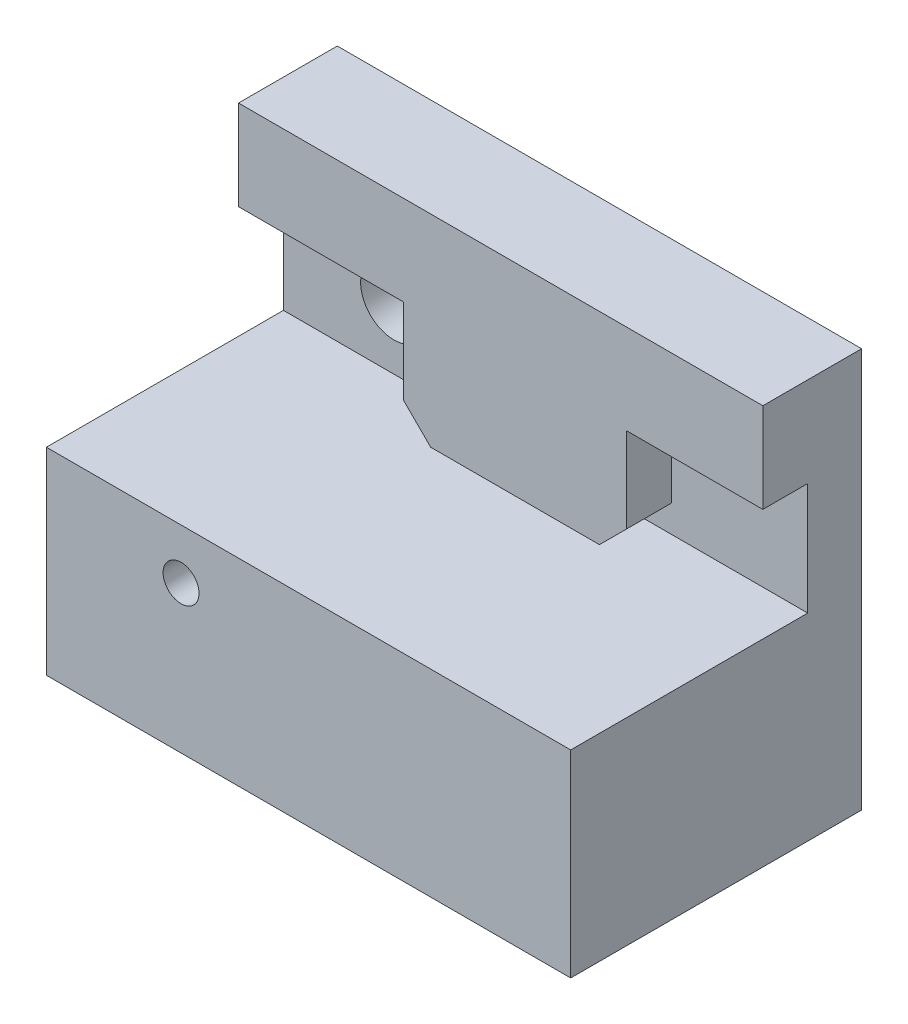
ISO-10303-21;
HEADER;
FILE_DESCRIPTION(('STEP AP214'),'2;1');
FILE_NAME('part.step','',(''),(''),'','','');
FILE_SCHEMA(('AUTOMOTIVE_DESIGN { 1 0 10303 214 1 1 1 1 }'));
ENDSEC;
DATA;
#1=APPLICATION_CONTEXT('core data for automotive mechanical design processes');
#2=APPLICATION_PROTOCOL_DEFINITION('international standard','automotive_design',2000,#1);
#3=PRODUCT_CONTEXT('',#1,'mechanical');
#4=PRODUCT('Part','Part','',(#3));
#5=PRODUCT_RELATED_PRODUCT_CATEGORY('part','',(#4));
#6=PRODUCT_DEFINITION_FORMATION('','',#4);
#7=PRODUCT_DEFINITION_CONTEXT('part definition',#1,'design');
#8=PRODUCT_DEFINITION('design','',#6,#7);
#9=PRODUCT_DEFINITION_SHAPE('','',#8);
#10=(LENGTH_UNIT() NAMED_UNIT(*) SI_UNIT(.MILLI.,.METRE.));
#11=(NAMED_UNIT(*) PLANE_ANGLE_UNIT() SI_UNIT($,.RADIAN.));
#12=(NAMED_UNIT(*) SI_UNIT($,.STERADIAN.) SOLID_ANGLE_UNIT());
#13=UNCERTAINTY_MEASURE_WITH_UNIT(LENGTH_MEASURE(1.E-05),#10,'distance_accuracy_value','');
#14=(GEOMETRIC_REPRESENTATION_CONTEXT(3) GLOBAL_UNCERTAINTY_ASSIGNED_CONTEXT((#13)) GLOBAL_UNIT_ASSIGNED_CONTEXT((#10,
#11,#12)) REPRESENTATION_CONTEXT('',''));
#15=CARTESIAN_POINT('',(0.,0.,0.));
#16=DIRECTION('',(0.,0.,1.));
#17=DIRECTION('',(1.,0.,0.));
#18=AXIS2_PLACEMENT_3D('',#15,#16,#17);
#19=CARTESIAN_POINT('',(0.,11.,13.2));
#20=DIRECTION('',(0.,-1.,0.));
#21=DIRECTION('',(0.,0.,-1.));
#22=AXIS2_PLACEMENT_3D('',#19,#20,#21);
#23=PLANE('',#22);
#24=DIRECTION('',(0.,0.,-1.));
#25=VECTOR('',#24,1.);
#26=CARTESIAN_POINT('',(20.1,11.,2.5));
#27=LINE('',#26,#25);
#28=CARTESIAN_POINT('',(20.1,11.,2.5));
#29=VERTEX_POINT('',#28);
#30=CARTESIAN_POINT('',(20.1,11.,0.));
#31=VERTEX_POINT('',#30);
#32=EDGE_CURVE('E235',#29,#31,#27,.T.);
#33=ORIENTED_EDGE('',*,*,#32,.F.);
#34=DIRECTION('',(-1.,0.,0.));
#35=VECTOR('',#34,1.);
#36=CARTESIAN_POINT('',(20.1,11.,2.5));
#37=LINE('',#36,#35);
#38=CARTESIAN_POINT('',(10.7,11.,2.5));
#39=VERTEX_POINT('',#38);
#40=EDGE_CURVE('E185',#29,#39,#37,.T.);
#41=ORIENTED_EDGE('',*,*,#40,.T.);
#42=DIRECTION('',(0.,0.,-1.));
#43=VECTOR('',#42,1.);
#44=CARTESIAN_POINT('',(10.7,11.,2.5));
#45=LINE('',#44,#43);
#46=CARTESIAN_POINT('',(10.7,11.,0.));
#47=VERTEX_POINT('',#46);
#48=EDGE_CURVE('E226',#39,#47,#45,.T.);
#49=ORIENTED_EDGE('',*,*,#48,.T.);
#50=DIRECTION('',(-1.,0.,0.));
#51=VECTOR('',#50,1.);
#52=CARTESIAN_POINT('',(0.,11.,0.));
#53=LINE('',#52,#51);
#54=CARTESIAN_POINT('',(0.,11.,0.));
#55=VERTEX_POINT('',#54);
#56=EDGE_CURVE('E273',#47,#55,#53,.T.);
#57=ORIENTED_EDGE('',*,*,#56,.T.);
#58=DIRECTION('',(0.,0.,-1.));
#59=VECTOR('',#58,1.);
#60=CARTESIAN_POINT('',(0.,11.,13.2));
#61=LINE('',#60,#59);
#62=CARTESIAN_POINT('',(0.,11.,13.2));
#63=VERTEX_POINT('',#62);
#64=EDGE_CURVE('E43',#63,#55,#61,.T.);
#65=ORIENTED_EDGE('',*,*,#64,.F.);
#66=DIRECTION('',(-1.,0.,0.));
#67=VECTOR('',#66,1.);
#68=CARTESIAN_POINT('',(0.,11.,13.2));
#69=LINE('',#68,#67);
#70=CARTESIAN_POINT('',(29.2,11.,13.2));
#71=VERTEX_POINT('',#70);
#72=EDGE_CURVE('E275',#71,#63,#69,.T.);
#73=ORIENTED_EDGE('',*,*,#72,.F.);
#74=DIRECTION('',(0.,0.,-1.));
#75=VECTOR('',#74,1.);
#76=CARTESIAN_POINT('',(29.2,11.,13.2));
#77=LINE('',#76,#75);
#78=CARTESIAN_POINT('',(29.2,11.,0.));
#79=VERTEX_POINT('',#78);
#80=EDGE_CURVE('E11',#71,#79,#77,.T.);
#81=ORIENTED_EDGE('',*,*,#80,.T.);
#82=EDGE_CURVE('E276',#79,#31,#53,.T.);
#83=ORIENTED_EDGE('',*,*,#82,.T.);
#84=EDGE_LOOP('',(#33,#41,#49,#57,#65,#73,#81,#83));
#85=FACE_BOUND('',#84,.T.);
#86=ADVANCED_FACE('F33',(#85),#23,.F.);
#87=CARTESIAN_POINT('',(7.5,8.2,13.2));
#88=DIRECTION('',(0.,0.,-1.));
#89=DIRECTION('',(-1.,0.,0.));
#90=AXIS2_PLACEMENT_3D('',#87,#88,#89);
#91=CYLINDRICAL_SURFACE('',#90,1.);
#92=CARTESIAN_POINT('',(7.5,8.2,13.2));
#93=DIRECTION('',(0.,0.,1.));
#94=DIRECTION('',(1.,0.,0.));
#95=AXIS2_PLACEMENT_3D('',#92,#93,#94);
#96=CIRCLE('',#95,1.);
#97=CARTESIAN_POINT('',(8.5,8.2,13.2));
#98=VERTEX_POINT('',#97);
#99=EDGE_CURVE('E268',#98,#98,#96,.T.);
#100=ORIENTED_EDGE('',*,*,#99,.T.);
#101=EDGE_LOOP('',(#100));
#102=FACE_BOUND('',#101,.T.);
#103=CARTESIAN_POINT('',(7.5,8.2,11.5));
#104=DIRECTION('',(0.,0.,-1.));
#105=DIRECTION('',(-1.,0.,0.));
#106=AXIS2_PLACEMENT_3D('',#103,#104,#105);
#107=CIRCLE('',#106,1.);
#108=CARTESIAN_POINT('',(6.5,8.2,11.5));
#109=VERTEX_POINT('',#108);
#110=EDGE_CURVE('E263',#109,#109,#107,.T.);
#111=ORIENTED_EDGE('',*,*,#110,.T.);
#112=EDGE_LOOP('',(#111));
#113=FACE_BOUND('',#112,.T.);
#114=ADVANCED_FACE('F314',(#102,#113),#91,.F.);
#115=CARTESIAN_POINT('',(0.,0.,13.2));
#116=DIRECTION('',(0.,0.,1.));
#117=DIRECTION('',(1.,0.,0.));
#118=AXIS2_PLACEMENT_3D('',#115,#116,#117);
#119=PLANE('',#118);
#120=DIRECTION('',(0.,1.,0.));
#121=VECTOR('',#120,1.);
#122=CARTESIAN_POINT('',(29.2,11.,13.2));
#123=LINE('',#122,#121);
#124=CARTESIAN_POINT('',(29.2,0.,13.2));
#125=VERTEX_POINT('',#124);
#126=EDGE_CURVE('E141',#125,#71,#123,.T.);
#127=ORIENTED_EDGE('',*,*,#126,.T.);
#128=ORIENTED_EDGE('',*,*,#72,.T.);
#129=DIRECTION('',(0.,-1.,0.));
#130=VECTOR('',#129,1.);
#131=CARTESIAN_POINT('',(0.,11.,13.2));
#132=LINE('',#131,#130);
#133=CARTESIAN_POINT('',(0.,0.,13.2));
#134=VERTEX_POINT('',#133);
#135=EDGE_CURVE('E56',#63,#134,#132,.T.);
#136=ORIENTED_EDGE('',*,*,#135,.T.);
#137=DIRECTION('',(1.,0.,0.));
#138=VECTOR('',#137,1.);
#139=CARTESIAN_POINT('',(0.,0.,13.2));
#140=LINE('',#139,#138);
#141=EDGE_CURVE('E51',#134,#125,#140,.T.);
#142=ORIENTED_EDGE('',*,*,#141,.T.);
#143=EDGE_LOOP('',(#127,#128,#136,#142));
#144=FACE_BOUND('',#143,.T.);
#145=ORIENTED_EDGE('',*,*,#99,.F.);
#146=EDGE_LOOP('',(#145));
#147=FACE_BOUND('',#146,.T.);
#148=ADVANCED_FACE('F311',(#144,#147),#119,.T.);
#149=CARTESIAN_POINT('',(29.2,11.,13.2));
#150=DIRECTION('',(-1.,0.,0.));
#151=DIRECTION('',(0.,-1.,0.));
#152=AXIS2_PLACEMENT_3D('',#149,#150,#151);
#153=PLANE('',#152);
#154=DIRECTION('',(0.,0.,-1.));
#155=VECTOR('',#154,1.);
#156=CARTESIAN_POINT('',(29.2,0.,13.2));
#157=LINE('',#156,#155);
#158=CARTESIAN_POINT('',(29.2,0.,-3.));
#159=VERTEX_POINT('',#158);
#160=EDGE_CURVE('E137',#125,#159,#157,.T.);
#161=ORIENTED_EDGE('',*,*,#160,.T.);
#162=DIRECTION('',(0.,-1.,0.));
#163=VECTOR('',#162,1.);
#164=CARTESIAN_POINT('',(29.2,22.25,-3.));
#165=LINE('',#164,#163);
#166=CARTESIAN_POINT('',(29.2,22.25,-3.));
#167=VERTEX_POINT('',#166);
#168=EDGE_CURVE('E139',#167,#159,#165,.T.);
#169=ORIENTED_EDGE('',*,*,#168,.F.);
#170=DIRECTION('',(0.,0.,-1.));
#171=VECTOR('',#170,1.);
#172=CARTESIAN_POINT('',(29.2,22.25,2.5));
#173=LINE('',#172,#171);
#174=CARTESIAN_POINT('',(29.2,22.25,2.5));
#175=VERTEX_POINT('',#174);
#176=EDGE_CURVE('E214',#175,#167,#173,.T.);
#177=ORIENTED_EDGE('',*,*,#176,.F.);
#178=DIRECTION('',(0.,-1.,0.));
#179=VECTOR('',#178,1.);
#180=CARTESIAN_POINT('',(29.2,22.25,2.5));
#181=LINE('',#180,#179);
#182=CARTESIAN_POINT('',(29.2,17.25,2.5));
#183=VERTEX_POINT('',#182);
#184=EDGE_CURVE('E203',#175,#183,#181,.T.);
#185=ORIENTED_EDGE('',*,*,#184,.T.);
#186=DIRECTION('',(0.,0.,-1.));
#187=VECTOR('',#186,1.);
#188=CARTESIAN_POINT('',(29.2,17.25,2.5));
#189=LINE('',#188,#187);
#190=CARTESIAN_POINT('',(29.2,17.25,0.));
#191=VERTEX_POINT('',#190);
#192=EDGE_CURVE('E216',#183,#191,#189,.T.);
#193=ORIENTED_EDGE('',*,*,#192,.T.);
#194=DIRECTION('',(0.,-1.,0.));
#195=VECTOR('',#194,1.);
#196=CARTESIAN_POINT('',(29.2,10.75,0.));
#197=LINE('',#196,#195);
#198=EDGE_CURVE('E169',#191,#79,#197,.T.);
#199=ORIENTED_EDGE('',*,*,#198,.T.);
#200=ORIENTED_EDGE('',*,*,#80,.F.);
#201=ORIENTED_EDGE('',*,*,#126,.F.);
#202=EDGE_LOOP('',(#161,#169,#177,#185,#193,#199,#200,#201));
#203=FACE_BOUND('',#202,.T.);
#204=ADVANCED_FACE('F35',(#203),#153,.F.);
#205=CARTESIAN_POINT('',(0.,11.,13.2));
#206=DIRECTION('',(1.,0.,0.));
#207=DIRECTION('',(0.,1.,0.));
#208=AXIS2_PLACEMENT_3D('',#205,#206,#207);
#209=PLANE('',#208);
#210=ORIENTED_EDGE('',*,*,#64,.T.);
#211=DIRECTION('',(0.,1.,0.));
#212=VECTOR('',#211,1.);
#213=CARTESIAN_POINT('',(0.,22.25,0.));
#214=LINE('',#213,#212);
#215=CARTESIAN_POINT('',(0.,17.25,0.));
#216=VERTEX_POINT('',#215);
#217=EDGE_CURVE('E156',#55,#216,#214,.T.);
#218=ORIENTED_EDGE('',*,*,#217,.T.);
#219=DIRECTION('',(0.,0.,-1.));
#220=VECTOR('',#219,1.);
#221=CARTESIAN_POINT('',(0.,17.25,2.5));
#222=LINE('',#221,#220);
#223=CARTESIAN_POINT('',(0.,17.25,2.5));
#224=VERTEX_POINT('',#223);
#225=EDGE_CURVE('E219',#224,#216,#222,.T.);
#226=ORIENTED_EDGE('',*,*,#225,.F.);
#227=DIRECTION('',(0.,1.,0.));
#228=VECTOR('',#227,1.);
#229=CARTESIAN_POINT('',(0.,17.25,2.5));
#230=LINE('',#229,#228);
#231=CARTESIAN_POINT('',(0.,22.25,2.5));
#232=VERTEX_POINT('',#231);
#233=EDGE_CURVE('E197',#224,#232,#230,.T.);
#234=ORIENTED_EDGE('',*,*,#233,.T.);
#235=DIRECTION('',(0.,0.,-1.));
#236=VECTOR('',#235,1.);
#237=CARTESIAN_POINT('',(0.,22.25,2.5));
#238=LINE('',#237,#236);
#239=CARTESIAN_POINT('',(0.,22.25,-3.));
#240=VERTEX_POINT('',#239);
#241=EDGE_CURVE('E217',#232,#240,#238,.T.);
#242=ORIENTED_EDGE('',*,*,#241,.T.);
#243=DIRECTION('',(0.,1.,0.));
#244=VECTOR('',#243,1.);
#245=CARTESIAN_POINT('',(0.,10.75,-3.));
#246=LINE('',#245,#244);
#247=CARTESIAN_POINT('',(0.,0.,-3.));
#248=VERTEX_POINT('',#247);
#249=EDGE_CURVE('E159',#248,#240,#246,.T.);
#250=ORIENTED_EDGE('',*,*,#249,.F.);
#251=DIRECTION('',(0.,0.,-1.));
#252=VECTOR('',#251,1.);
#253=CARTESIAN_POINT('',(0.,0.,13.2));
#254=LINE('',#253,#252);
#255=EDGE_CURVE('E144',#134,#248,#254,.T.);
#256=ORIENTED_EDGE('',*,*,#255,.F.);
#257=ORIENTED_EDGE('',*,*,#135,.F.);
#258=EDGE_LOOP('',(#210,#218,#226,#234,#242,#250,#256,#257));
#259=FACE_BOUND('',#258,.T.);
#260=ADVANCED_FACE('F293',(#259),#209,.F.);
#261=CARTESIAN_POINT('',(0.,0.,13.2));
#262=DIRECTION('',(0.,1.,0.));
#263=DIRECTION('',(0.,0.,1.));
#264=AXIS2_PLACEMENT_3D('',#261,#262,#263);
#265=PLANE('',#264);
#266=ORIENTED_EDGE('',*,*,#255,.T.);
#267=DIRECTION('',(-1.,0.,0.));
#268=VECTOR('',#267,1.);
#269=CARTESIAN_POINT('',(0.,0.,-3.));
#270=LINE('',#269,#268);
#271=EDGE_CURVE('E152',#159,#248,#270,.T.);
#272=ORIENTED_EDGE('',*,*,#271,.F.);
#273=ORIENTED_EDGE('',*,*,#160,.F.);
#274=ORIENTED_EDGE('',*,*,#141,.F.);
#275=EDGE_LOOP('',(#266,#272,#273,#274));
#276=FACE_BOUND('',#275,.T.);
#277=ADVANCED_FACE('F158',(#276),#265,.F.);
#278=CARTESIAN_POINT('',(7.5,8.2,11.5));
#279=DIRECTION('',(0.,0.,-1.));
#280=DIRECTION('',(-1.,0.,0.));
#281=AXIS2_PLACEMENT_3D('',#278,#279,#280);
#282=CYLINDRICAL_SURFACE('',#281,1.85);
#283=CARTESIAN_POINT('',(7.5,8.2,11.5));
#284=DIRECTION('',(0.,0.,-1.));
#285=DIRECTION('',(-1.,0.,0.));
#286=AXIS2_PLACEMENT_3D('',#283,#284,#285);
#287=CIRCLE('',#286,1.85);
#288=CARTESIAN_POINT('',(5.65,8.2,11.5));
#289=VERTEX_POINT('',#288);
#290=EDGE_CURVE('E259',#289,#289,#287,.T.);
#291=ORIENTED_EDGE('',*,*,#290,.F.);
#292=EDGE_LOOP('',(#291));
#293=FACE_BOUND('',#292,.T.);
#294=CARTESIAN_POINT('',(7.49999999999998,8.2,-3.));
#295=DIRECTION('',(0.,0.,-1.));
#296=DIRECTION('',(1.,0.,0.));
#297=AXIS2_PLACEMENT_3D('',#294,#295,#296);
#298=CIRCLE('',#297,1.85000000000003);
#299=CARTESIAN_POINT('',(9.35000000000001,8.2,-3.));
#300=VERTEX_POINT('',#299);
#301=EDGE_CURVE('E172',#300,#300,#298,.T.);
#302=ORIENTED_EDGE('',*,*,#301,.T.);
#303=EDGE_LOOP('',(#302));
#304=FACE_BOUND('',#303,.T.);
#305=ADVANCED_FACE('F325',(#293,#304),#282,.F.);
#306=CARTESIAN_POINT('',(7.5,8.2,11.5));
#307=DIRECTION('',(0.,0.,-1.));
#308=DIRECTION('',(-1.,0.,0.));
#309=AXIS2_PLACEMENT_3D('',#306,#307,#308);
#310=PLANE('',#309);
#311=ORIENTED_EDGE('',*,*,#110,.F.);
#312=EDGE_LOOP('',(#311));
#313=FACE_BOUND('',#312,.T.);
#314=ORIENTED_EDGE('',*,*,#290,.T.);
#315=EDGE_LOOP('',(#314));
#316=FACE_BOUND('',#315,.T.);
#317=ADVANCED_FACE('F323',(#313,#316),#310,.T.);
#318=CARTESIAN_POINT('',(29.2,17.25,2.5));
#319=DIRECTION('',(0.,-1.,0.));
#320=DIRECTION('',(0.,0.,-1.));
#321=AXIS2_PLACEMENT_3D('',#318,#319,#320);
#322=PLANE('',#321);
#323=DIRECTION('',(-1.,0.,0.));
#324=VECTOR('',#323,1.);
#325=CARTESIAN_POINT('',(29.2,17.25,0.));
#326=LINE('',#325,#324);
#327=CARTESIAN_POINT('',(21.6,17.25,0.));
#328=VERTEX_POINT('',#327);
#329=EDGE_CURVE('E37',#191,#328,#326,.T.);
#330=ORIENTED_EDGE('',*,*,#329,.F.);
#331=ORIENTED_EDGE('',*,*,#192,.F.);
#332=DIRECTION('',(-1.,0.,0.));
#333=VECTOR('',#332,1.);
#334=CARTESIAN_POINT('',(29.2,17.25,2.5));
#335=LINE('',#334,#333);
#336=CARTESIAN_POINT('',(21.6,17.25,2.5));
#337=VERTEX_POINT('',#336);
#338=EDGE_CURVE('E175',#183,#337,#335,.T.);
#339=ORIENTED_EDGE('',*,*,#338,.T.);
#340=DIRECTION('',(0.,0.,-1.));
#341=VECTOR('',#340,1.);
#342=CARTESIAN_POINT('',(21.6,17.25,2.5));
#343=LINE('',#342,#341);
#344=EDGE_CURVE('E205',#337,#328,#343,.T.);
#345=ORIENTED_EDGE('',*,*,#344,.T.);
#346=EDGE_LOOP('',(#330,#331,#339,#345));
#347=FACE_BOUND('',#346,.T.);
#348=ADVANCED_FACE('F306',(#347),#322,.T.);
#349=CARTESIAN_POINT('',(29.2,22.25,2.5));
#350=DIRECTION('',(0.,1.,0.));
#351=DIRECTION('',(0.,0.,1.));
#352=AXIS2_PLACEMENT_3D('',#349,#350,#351);
#353=PLANE('',#352);
#354=ORIENTED_EDGE('',*,*,#176,.T.);
#355=DIRECTION('',(1.,0.,0.));
#356=VECTOR('',#355,1.);
#357=CARTESIAN_POINT('',(29.2,22.25,-3.));
#358=LINE('',#357,#356);
#359=EDGE_CURVE('E155',#240,#167,#358,.T.);
#360=ORIENTED_EDGE('',*,*,#359,.F.);
#361=ORIENTED_EDGE('',*,*,#241,.F.);
#362=DIRECTION('',(1.,0.,0.));
#363=VECTOR('',#362,1.);
#364=CARTESIAN_POINT('',(29.2,22.25,2.5));
#365=LINE('',#364,#363);
#366=EDGE_CURVE('E200',#232,#175,#365,.T.);
#367=ORIENTED_EDGE('',*,*,#366,.T.);
#368=EDGE_LOOP('',(#354,#360,#361,#367));
#369=FACE_BOUND('',#368,.T.);
#370=ADVANCED_FACE('F295',(#369),#353,.T.);
#371=CARTESIAN_POINT('',(9.2,17.25,2.5));
#372=DIRECTION('',(0.,-1.,0.));
#373=DIRECTION('',(0.,0.,-1.));
#374=AXIS2_PLACEMENT_3D('',#371,#372,#373);
#375=PLANE('',#374);
#376=DIRECTION('',(-1.,0.,0.));
#377=VECTOR('',#376,1.);
#378=CARTESIAN_POINT('',(9.2,17.25,0.));
#379=LINE('',#378,#377);
#380=CARTESIAN_POINT('',(9.2,17.25,0.));
#381=VERTEX_POINT('',#380);
#382=EDGE_CURVE('E179',#381,#216,#379,.T.);
#383=ORIENTED_EDGE('',*,*,#382,.F.);
#384=DIRECTION('',(0.,0.,-1.));
#385=VECTOR('',#384,1.);
#386=CARTESIAN_POINT('',(9.2,17.25,2.5));
#387=LINE('',#386,#385);
#388=CARTESIAN_POINT('',(9.2,17.25,2.5));
#389=VERTEX_POINT('',#388);
#390=EDGE_CURVE('E220',#389,#381,#387,.T.);
#391=ORIENTED_EDGE('',*,*,#390,.F.);
#392=DIRECTION('',(-1.,0.,0.));
#393=VECTOR('',#392,1.);
#394=CARTESIAN_POINT('',(9.2,17.25,2.5));
#395=LINE('',#394,#393);
#396=EDGE_CURVE('E194',#389,#224,#395,.T.);
#397=ORIENTED_EDGE('',*,*,#396,.T.);
#398=ORIENTED_EDGE('',*,*,#225,.T.);
#399=EDGE_LOOP('',(#383,#391,#397,#398));
#400=FACE_BOUND('',#399,.T.);
#401=ADVANCED_FACE('F368',(#400),#375,.T.);
#402=CARTESIAN_POINT('',(9.2,12.5,2.5));
#403=DIRECTION('',(-1.,0.,0.));
#404=DIRECTION('',(0.,0.,1.));
#405=AXIS2_PLACEMENT_3D('',#402,#403,#404);
#406=PLANE('',#405);
#407=DIRECTION('',(0.,1.,0.));
#408=VECTOR('',#407,1.);
#409=CARTESIAN_POINT('',(9.2,12.5,0.));
#410=LINE('',#409,#408);
#411=CARTESIAN_POINT('',(9.2,12.5,0.));
#412=VERTEX_POINT('',#411);
#413=EDGE_CURVE('E211',#412,#381,#410,.T.);
#414=ORIENTED_EDGE('',*,*,#413,.F.);
#415=DIRECTION('',(0.,0.,-1.));
#416=VECTOR('',#415,1.);
#417=CARTESIAN_POINT('',(9.2,12.5,2.5));
#418=LINE('',#417,#416);
#419=CARTESIAN_POINT('',(9.2,12.5,2.5));
#420=VERTEX_POINT('',#419);
#421=EDGE_CURVE('E223',#420,#412,#418,.T.);
#422=ORIENTED_EDGE('',*,*,#421,.F.);
#423=DIRECTION('',(0.,1.,0.));
#424=VECTOR('',#423,1.);
#425=CARTESIAN_POINT('',(9.2,12.5,2.5));
#426=LINE('',#425,#424);
#427=EDGE_CURVE('E191',#420,#389,#426,.T.);
#428=ORIENTED_EDGE('',*,*,#427,.T.);
#429=ORIENTED_EDGE('',*,*,#390,.T.);
#430=EDGE_LOOP('',(#414,#422,#428,#429));
#431=FACE_BOUND('',#430,.T.);
#432=ADVANCED_FACE('F378',(#431),#406,.T.);
#433=CARTESIAN_POINT('',(10.7,11.,2.5));
#434=DIRECTION('',(-0.707106781186549,-0.707106781186546,0.));
#435=DIRECTION('',(0.707106781186546,-0.707106781186549,0.));
#436=AXIS2_PLACEMENT_3D('',#433,#434,#435);
#437=PLANE('',#436);
#438=DIRECTION('',(-0.707106781186546,0.707106781186549,0.));
#439=VECTOR('',#438,1.);
#440=CARTESIAN_POINT('',(10.7,11.,0.));
#441=LINE('',#440,#439);
#442=EDGE_CURVE('E213',#47,#412,#441,.T.);
#443=ORIENTED_EDGE('',*,*,#442,.F.);
#444=ORIENTED_EDGE('',*,*,#48,.F.);
#445=DIRECTION('',(-0.707106781186546,0.707106781186549,0.));
#446=VECTOR('',#445,1.);
#447=CARTESIAN_POINT('',(10.7,11.,2.5));
#448=LINE('',#447,#446);
#449=EDGE_CURVE('E188',#39,#420,#448,.T.);
#450=ORIENTED_EDGE('',*,*,#449,.T.);
#451=ORIENTED_EDGE('',*,*,#421,.T.);
#452=EDGE_LOOP('',(#443,#444,#450,#451));
#453=FACE_BOUND('',#452,.T.);
#454=ADVANCED_FACE('F388',(#453),#437,.T.);
#455=CARTESIAN_POINT('',(20.1,11.,2.5));
#456=DIRECTION('',(0.707106781186549,-0.707106781186546,0.));
#457=DIRECTION('',(0.707106781186546,0.707106781186549,0.));
#458=AXIS2_PLACEMENT_3D('',#455,#456,#457);
#459=PLANE('',#458);
#460=DIRECTION('',(-0.707106781186546,-0.707106781186549,0.));
#461=VECTOR('',#460,1.);
#462=CARTESIAN_POINT('',(20.1,11.,0.));
#463=LINE('',#462,#461);
#464=CARTESIAN_POINT('',(21.6,12.5,0.));
#465=VERTEX_POINT('',#464);
#466=EDGE_CURVE('E210',#465,#31,#463,.T.);
#467=ORIENTED_EDGE('',*,*,#466,.F.);
#468=DIRECTION('',(0.,0.,-1.));
#469=VECTOR('',#468,1.);
#470=CARTESIAN_POINT('',(21.6,12.5,2.5));
#471=LINE('',#470,#469);
#472=CARTESIAN_POINT('',(21.6,12.5,2.5));
#473=VERTEX_POINT('',#472);
#474=EDGE_CURVE('E229',#473,#465,#471,.T.);
#475=ORIENTED_EDGE('',*,*,#474,.F.);
#476=DIRECTION('',(-0.707106781186546,-0.707106781186549,0.));
#477=VECTOR('',#476,1.);
#478=CARTESIAN_POINT('',(20.1,11.,2.5));
#479=LINE('',#478,#477);
#480=EDGE_CURVE('E182',#473,#29,#479,.T.);
#481=ORIENTED_EDGE('',*,*,#480,.T.);
#482=ORIENTED_EDGE('',*,*,#32,.T.);
#483=EDGE_LOOP('',(#467,#475,#481,#482));
#484=FACE_BOUND('',#483,.T.);
#485=ADVANCED_FACE('F398',(#484),#459,.T.);
#486=CARTESIAN_POINT('',(21.6,17.25,2.5));
#487=DIRECTION('',(1.,0.,0.));
#488=DIRECTION('',(0.,0.,-1.));
#489=AXIS2_PLACEMENT_3D('',#486,#487,#488);
#490=PLANE('',#489);
#491=DIRECTION('',(0.,-1.,0.));
#492=VECTOR('',#491,1.);
#493=CARTESIAN_POINT('',(21.6,17.25,0.));
#494=LINE('',#493,#492);
#495=EDGE_CURVE('E208',#328,#465,#494,.T.);
#496=ORIENTED_EDGE('',*,*,#495,.F.);
#497=ORIENTED_EDGE('',*,*,#344,.F.);
#498=DIRECTION('',(0.,-1.,0.));
#499=VECTOR('',#498,1.);
#500=CARTESIAN_POINT('',(21.6,17.25,2.5));
#501=LINE('',#500,#499);
#502=EDGE_CURVE('E178',#337,#473,#501,.T.);
#503=ORIENTED_EDGE('',*,*,#502,.T.);
#504=ORIENTED_EDGE('',*,*,#474,.T.);
#505=EDGE_LOOP('',(#496,#497,#503,#504));
#506=FACE_BOUND('',#505,.T.);
#507=ADVANCED_FACE('F408',(#506),#490,.T.);
#508=CARTESIAN_POINT('',(0.,0.,2.5));
#509=DIRECTION('',(0.,0.,1.));
#510=DIRECTION('',(1.,0.,0.));
#511=AXIS2_PLACEMENT_3D('',#508,#509,#510);
#512=PLANE('',#511);
#513=ORIENTED_EDGE('',*,*,#338,.F.);
#514=ORIENTED_EDGE('',*,*,#184,.F.);
#515=ORIENTED_EDGE('',*,*,#366,.F.);
#516=ORIENTED_EDGE('',*,*,#233,.F.);
#517=ORIENTED_EDGE('',*,*,#396,.F.);
#518=ORIENTED_EDGE('',*,*,#427,.F.);
#519=ORIENTED_EDGE('',*,*,#449,.F.);
#520=ORIENTED_EDGE('',*,*,#40,.F.);
#521=ORIENTED_EDGE('',*,*,#480,.F.);
#522=ORIENTED_EDGE('',*,*,#502,.F.);
#523=EDGE_LOOP('',(#513,#514,#515,#516,#517,#518,#519,#520,#521,#522));
#524=FACE_BOUND('',#523,.T.);
#525=ADVANCED_FACE('F300',(#524),#512,.T.);
#526=CARTESIAN_POINT('',(0.,0.,0.));
#527=DIRECTION('',(0.,0.,1.));
#528=DIRECTION('',(1.,0.,0.));
#529=AXIS2_PLACEMENT_3D('',#526,#527,#528);
#530=PLANE('',#529);
#531=CARTESIAN_POINT('',(6.14999999999999,14.5,0.));
#532=DIRECTION('',(0.,0.,-1.));
#533=DIRECTION('',(1.,0.,0.));
#534=AXIS2_PLACEMENT_3D('',#531,#532,#533);
#535=CIRCLE('',#534,1.85);
#536=CARTESIAN_POINT('',(7.99999999999999,14.5,0.));
#537=VERTEX_POINT('',#536);
#538=EDGE_CURVE('E531',#537,#537,#535,.T.);
#539=ORIENTED_EDGE('',*,*,#538,.T.);
#540=EDGE_LOOP('',(#539));
#541=FACE_BOUND('',#540,.T.);
#542=ORIENTED_EDGE('',*,*,#56,.F.);
#543=ORIENTED_EDGE('',*,*,#442,.T.);
#544=ORIENTED_EDGE('',*,*,#413,.T.);
#545=ORIENTED_EDGE('',*,*,#382,.T.);
#546=ORIENTED_EDGE('',*,*,#217,.F.);
#547=EDGE_LOOP('',(#542,#543,#544,#545,#546));
#548=FACE_BOUND('',#547,.T.);
#549=ADVANCED_FACE('F425',(#541,#548),#530,.T.);
#550=CARTESIAN_POINT('',(0.,0.,-3.));
#551=DIRECTION('',(0.,0.,1.));
#552=DIRECTION('',(1.,0.,0.));
#553=AXIS2_PLACEMENT_3D('',#550,#551,#552);
#554=PLANE('',#553);
#555=ORIENTED_EDGE('',*,*,#301,.F.);
#556=EDGE_LOOP('',(#555));
#557=FACE_BOUND('',#556,.T.);
#558=ORIENTED_EDGE('',*,*,#168,.T.);
#559=ORIENTED_EDGE('',*,*,#271,.T.);
#560=ORIENTED_EDGE('',*,*,#249,.T.);
#561=ORIENTED_EDGE('',*,*,#359,.T.);
#562=EDGE_LOOP('',(#558,#559,#560,#561));
#563=FACE_BOUND('',#562,.T.);
#564=CARTESIAN_POINT('',(6.14999999999999,14.5,-3.));
#565=DIRECTION('',(0.,0.,-1.));
#566=DIRECTION('',(1.,0.,0.));
#567=AXIS2_PLACEMENT_3D('',#564,#565,#566);
#568=CIRCLE('',#567,1.85);
#569=CARTESIAN_POINT('',(7.99999999999999,14.5,-3.));
#570=VERTEX_POINT('',#569);
#571=EDGE_CURVE('E528',#570,#570,#568,.T.);
#572=ORIENTED_EDGE('',*,*,#571,.F.);
#573=EDGE_LOOP('',(#572));
#574=FACE_BOUND('',#573,.T.);
#575=ADVANCED_FACE('F149',(#557,#563,#574),#554,.F.);
#576=ORIENTED_EDGE('',*,*,#198,.F.);
#577=ORIENTED_EDGE('',*,*,#329,.T.);
#578=ORIENTED_EDGE('',*,*,#495,.T.);
#579=ORIENTED_EDGE('',*,*,#466,.T.);
#580=ORIENTED_EDGE('',*,*,#82,.F.);
#581=EDGE_LOOP('',(#576,#577,#578,#579,#580));
#582=FACE_BOUND('',#581,.T.);
#583=ADVANCED_FACE('F309',(#582),#530,.T.);
#584=CARTESIAN_POINT('',(6.14999999999999,14.5,-3.));
#585=DIRECTION('',(0.,0.,1.));
#586=DIRECTION('',(1.,0.,0.));
#587=AXIS2_PLACEMENT_3D('',#584,#585,#586);
#588=CYLINDRICAL_SURFACE('',#587,1.85);
#589=ORIENTED_EDGE('',*,*,#571,.T.);
#590=EDGE_LOOP('',(#589));
#591=FACE_BOUND('',#590,.T.);
#592=ORIENTED_EDGE('',*,*,#538,.F.);
#593=EDGE_LOOP('',(#592));
#594=FACE_BOUND('',#593,.T.);
#595=ADVANCED_FACE('F447',(#591,#594),#588,.F.);
#596=CLOSED_SHELL('',(#86,#114,#148,#204,#260,#277,#305,#317,#348,#370,#401,#432,#454,#485,#507,
#525,#549,#575,#583,#595));
#597=MANIFOLD_SOLID_BREP('B2',#596);
#598=ADVANCED_BREP_SHAPE_REPRESENTATION('',(#18,#597),#14);
#599=SHAPE_DEFINITION_REPRESENTATION(#9,#598);
ENDSEC;
END-ISO-10303-21;
